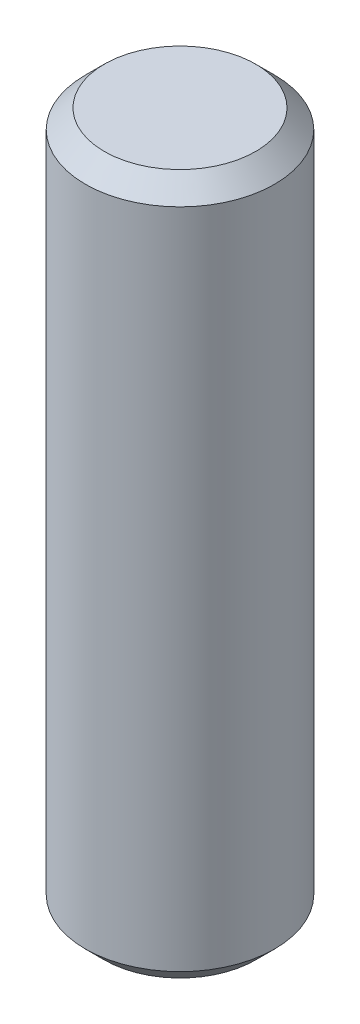
ISO-10303-21;
HEADER;
FILE_DESCRIPTION(('STEP AP214'),'2;1');
FILE_NAME('part.step','',(''),(''),'','','');
FILE_SCHEMA(('AUTOMOTIVE_DESIGN { 1 0 10303 214 1 1 1 1 }'));
ENDSEC;
DATA;
#1=APPLICATION_CONTEXT('core data for automotive mechanical design processes');
#2=APPLICATION_PROTOCOL_DEFINITION('international standard','automotive_design',2000,#1);
#3=PRODUCT_CONTEXT('',#1,'mechanical');
#4=PRODUCT('Part','Part','',(#3));
#5=PRODUCT_RELATED_PRODUCT_CATEGORY('part','',(#4));
#6=PRODUCT_DEFINITION_FORMATION('','',#4);
#7=PRODUCT_DEFINITION_CONTEXT('part definition',#1,'design');
#8=PRODUCT_DEFINITION('design','',#6,#7);
#9=PRODUCT_DEFINITION_SHAPE('','',#8);
#10=(LENGTH_UNIT() NAMED_UNIT(*) SI_UNIT(.MILLI.,.METRE.));
#11=(NAMED_UNIT(*) PLANE_ANGLE_UNIT() SI_UNIT($,.RADIAN.));
#12=(NAMED_UNIT(*) SI_UNIT($,.STERADIAN.) SOLID_ANGLE_UNIT());
#13=UNCERTAINTY_MEASURE_WITH_UNIT(LENGTH_MEASURE(1.E-05),#10,'distance_accuracy_value','');
#14=(GEOMETRIC_REPRESENTATION_CONTEXT(3) GLOBAL_UNCERTAINTY_ASSIGNED_CONTEXT((#13)) GLOBAL_UNIT_ASSIGNED_CONTEXT((#10,
#11,#12)) REPRESENTATION_CONTEXT('',''));
#15=CARTESIAN_POINT('',(0.,0.,0.));
#16=DIRECTION('',(0.,0.,1.));
#17=DIRECTION('',(1.,0.,0.));
#18=AXIS2_PLACEMENT_3D('',#15,#16,#17);
#19=CARTESIAN_POINT('',(0.,37.,0.));
#20=DIRECTION('',(0.,-1.,0.));
#21=DIRECTION('',(0.,0.,-1.));
#22=AXIS2_PLACEMENT_3D('',#19,#20,#21);
#23=CYLINDRICAL_SURFACE('',#22,10.);
#24=CARTESIAN_POINT('',(0.,-35.,0.));
#25=DIRECTION('',(0.,1.,0.));
#26=DIRECTION('',(0.,0.,1.));
#27=AXIS2_PLACEMENT_3D('',#24,#25,#26);
#28=CIRCLE('',#27,10.);
#29=CARTESIAN_POINT('',(0.,-35.,10.));
#30=VERTEX_POINT('',#29);
#31=EDGE_CURVE('E61',#30,#30,#28,.T.);
#32=ORIENTED_EDGE('',*,*,#31,.T.);
#33=EDGE_LOOP('',(#32));
#34=FACE_BOUND('',#33,.T.);
#35=CARTESIAN_POINT('',(0.,35.,0.));
#36=DIRECTION('',(0.,1.,0.));
#37=DIRECTION('',(0.,0.,1.));
#38=AXIS2_PLACEMENT_3D('',#35,#36,#37);
#39=CIRCLE('',#38,10.);
#40=CARTESIAN_POINT('',(0.,35.,10.));
#41=VERTEX_POINT('',#40);
#42=EDGE_CURVE('E65',#41,#41,#39,.F.);
#43=ORIENTED_EDGE('',*,*,#42,.T.);
#44=EDGE_LOOP('',(#43));
#45=FACE_BOUND('',#44,.T.);
#46=ADVANCED_FACE('F49',(#34,#45),#23,.T.);
#47=CARTESIAN_POINT('',(0.,37.,0.));
#48=DIRECTION('',(0.,1.,0.));
#49=DIRECTION('',(0.,0.,1.));
#50=AXIS2_PLACEMENT_3D('',#47,#48,#49);
#51=PLANE('',#50);
#52=CARTESIAN_POINT('',(0.,37.,0.));
#53=DIRECTION('',(0.,1.,0.));
#54=DIRECTION('',(0.,0.,1.));
#55=AXIS2_PLACEMENT_3D('',#52,#53,#54);
#56=CIRCLE('',#55,7.99999999999999);
#57=CARTESIAN_POINT('',(0.,37.,7.99999999999999));
#58=VERTEX_POINT('',#57);
#59=EDGE_CURVE('E10',#58,#58,#56,.T.);
#60=ORIENTED_EDGE('',*,*,#59,.T.);
#61=EDGE_LOOP('',(#60));
#62=FACE_BOUND('',#61,.T.);
#63=ADVANCED_FACE('F81',(#62),#51,.T.);
#64=CARTESIAN_POINT('',(0.,-37.,0.));
#65=DIRECTION('',(0.,1.,0.));
#66=DIRECTION('',(0.,0.,1.));
#67=AXIS2_PLACEMENT_3D('',#64,#65,#66);
#68=PLANE('',#67);
#69=CARTESIAN_POINT('',(0.,-37.,0.));
#70=DIRECTION('',(0.,1.,0.));
#71=DIRECTION('',(0.,0.,1.));
#72=AXIS2_PLACEMENT_3D('',#69,#70,#71);
#73=CIRCLE('',#72,7.99999999999996);
#74=CARTESIAN_POINT('',(0.,-37.,7.99999999999996));
#75=VERTEX_POINT('',#74);
#76=EDGE_CURVE('E57',#75,#75,#73,.F.);
#77=ORIENTED_EDGE('',*,*,#76,.T.);
#78=EDGE_LOOP('',(#77));
#79=FACE_BOUND('',#78,.T.);
#80=ADVANCED_FACE('F78',(#79),#68,.F.);
#81=CARTESIAN_POINT('',(0.,-35.,0.));
#82=DIRECTION('',(0.,1.,0.));
#83=DIRECTION('',(0.,0.,1.));
#84=AXIS2_PLACEMENT_3D('',#81,#82,#83);
#85=CONICAL_SURFACE('',#84,10.,0.785398163397448);
#86=ORIENTED_EDGE('',*,*,#76,.F.);
#87=EDGE_LOOP('',(#86));
#88=FACE_BOUND('',#87,.T.);
#89=ORIENTED_EDGE('',*,*,#31,.F.);
#90=EDGE_LOOP('',(#89));
#91=FACE_BOUND('',#90,.T.);
#92=ADVANCED_FACE('F74',(#88,#91),#85,.T.);
#93=CARTESIAN_POINT('',(0.,37.,0.));
#94=DIRECTION('',(0.,-1.,0.));
#95=DIRECTION('',(0.,0.,-1.));
#96=AXIS2_PLACEMENT_3D('',#93,#94,#95);
#97=CONICAL_SURFACE('',#96,7.99999999999999,0.785398163397448);
#98=ORIENTED_EDGE('',*,*,#42,.F.);
#99=EDGE_LOOP('',(#98));
#100=FACE_BOUND('',#99,.T.);
#101=ORIENTED_EDGE('',*,*,#59,.F.);
#102=EDGE_LOOP('',(#101));
#103=FACE_BOUND('',#102,.T.);
#104=ADVANCED_FACE('F52',(#100,#103),#97,.T.);
#105=CLOSED_SHELL('',(#46,#63,#80,#92,#104));
#106=MANIFOLD_SOLID_BREP('B2',#105);
#107=ADVANCED_BREP_SHAPE_REPRESENTATION('',(#18,#106),#14);
#108=SHAPE_DEFINITION_REPRESENTATION(#9,#107);
ENDSEC;
END-ISO-10303-21;
